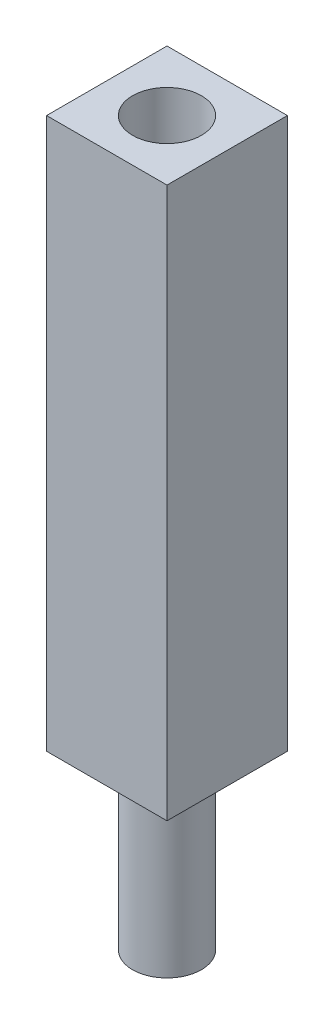
ISO-10303-21;
HEADER;
FILE_DESCRIPTION(('STEP AP214'),'2;1');
FILE_NAME('part.step','',(''),(''),'','','');
FILE_SCHEMA(('AUTOMOTIVE_DESIGN { 1 0 10303 214 1 1 1 1 }'));
ENDSEC;
DATA;
#1=APPLICATION_CONTEXT('core data for automotive mechanical design processes');
#2=APPLICATION_PROTOCOL_DEFINITION('international standard','automotive_design',2000,#1);
#3=PRODUCT_CONTEXT('',#1,'mechanical');
#4=PRODUCT('Part','Part','',(#3));
#5=PRODUCT_RELATED_PRODUCT_CATEGORY('part','',(#4));
#6=PRODUCT_DEFINITION_FORMATION('','',#4);
#7=PRODUCT_DEFINITION_CONTEXT('part definition',#1,'design');
#8=PRODUCT_DEFINITION('design','',#6,#7);
#9=PRODUCT_DEFINITION_SHAPE('','',#8);
#10=(LENGTH_UNIT() NAMED_UNIT(*) SI_UNIT(.MILLI.,.METRE.));
#11=(NAMED_UNIT(*) PLANE_ANGLE_UNIT() SI_UNIT($,.RADIAN.));
#12=(NAMED_UNIT(*) SI_UNIT($,.STERADIAN.) SOLID_ANGLE_UNIT());
#13=UNCERTAINTY_MEASURE_WITH_UNIT(LENGTH_MEASURE(1.E-05),#10,'distance_accuracy_value','');
#14=(GEOMETRIC_REPRESENTATION_CONTEXT(3) GLOBAL_UNCERTAINTY_ASSIGNED_CONTEXT((#13)) GLOBAL_UNIT_ASSIGNED_CONTEXT((#10,
#11,#12)) REPRESENTATION_CONTEXT('',''));
#15=CARTESIAN_POINT('',(0.,0.,0.));
#16=DIRECTION('',(0.,0.,1.));
#17=DIRECTION('',(1.,0.,0.));
#18=AXIS2_PLACEMENT_3D('',#15,#16,#17);
#19=CARTESIAN_POINT('',(0.,10.,0.));
#20=DIRECTION('',(0.,-1.,0.));
#21=DIRECTION('',(0.,0.,-1.));
#22=AXIS2_PLACEMENT_3D('',#19,#20,#21);
#23=CYLINDRICAL_SURFACE('',#22,2.);
#24=CARTESIAN_POINT('',(0.,10.,0.));
#25=DIRECTION('',(0.,1.,0.));
#26=DIRECTION('',(0.,0.,1.));
#27=AXIS2_PLACEMENT_3D('',#24,#25,#26);
#28=CIRCLE('',#27,2.);
#29=CARTESIAN_POINT('',(0.,10.,2.));
#30=VERTEX_POINT('',#29);
#31=EDGE_CURVE('E59',#30,#30,#28,.T.);
#32=ORIENTED_EDGE('',*,*,#31,.F.);
#33=EDGE_LOOP('',(#32));
#34=FACE_BOUND('',#33,.T.);
#35=CARTESIAN_POINT('',(0.,0.,0.));
#36=DIRECTION('',(0.,1.,0.));
#37=DIRECTION('',(0.,0.,1.));
#38=AXIS2_PLACEMENT_3D('',#35,#36,#37);
#39=CIRCLE('',#38,2.);
#40=CARTESIAN_POINT('',(0.,0.,2.));
#41=VERTEX_POINT('',#40);
#42=EDGE_CURVE('E131',#41,#41,#39,.T.);
#43=ORIENTED_EDGE('',*,*,#42,.T.);
#44=EDGE_LOOP('',(#43));
#45=FACE_BOUND('',#44,.T.);
#46=ADVANCED_FACE('F52',(#34,#45),#23,.T.);
#47=CARTESIAN_POINT('',(0.,0.,0.));
#48=DIRECTION('',(0.,1.,0.));
#49=DIRECTION('',(0.,0.,1.));
#50=AXIS2_PLACEMENT_3D('',#47,#48,#49);
#51=PLANE('',#50);
#52=ORIENTED_EDGE('',*,*,#42,.F.);
#53=EDGE_LOOP('',(#52));
#54=FACE_BOUND('',#53,.T.);
#55=ADVANCED_FACE('F139',(#54),#51,.F.);
#56=CARTESIAN_POINT('',(0.,12.,3.5));
#57=DIRECTION('',(0.,0.,1.));
#58=DIRECTION('',(1.,0.,0.));
#59=AXIS2_PLACEMENT_3D('',#56,#57,#58);
#60=PLANE('',#59);
#61=DIRECTION('',(-1.,0.,0.));
#62=VECTOR('',#61,1.);
#63=CARTESIAN_POINT('',(0.,10.,3.5));
#64=LINE('',#63,#62);
#65=CARTESIAN_POINT('',(3.5,10.,3.5));
#66=VERTEX_POINT('',#65);
#67=CARTESIAN_POINT('',(-3.5,10.,3.5));
#68=VERTEX_POINT('',#67);
#69=EDGE_CURVE('E123',#66,#68,#64,.T.);
#70=ORIENTED_EDGE('',*,*,#69,.F.);
#71=DIRECTION('',(0.,-1.,0.));
#72=VECTOR('',#71,1.);
#73=CARTESIAN_POINT('',(3.5,12.,3.5));
#74=LINE('',#73,#72);
#75=CARTESIAN_POINT('',(3.5,42.,3.5));
#76=VERTEX_POINT('',#75);
#77=EDGE_CURVE('E66',#76,#66,#74,.T.);
#78=ORIENTED_EDGE('',*,*,#77,.F.);
#79=DIRECTION('',(-1.,0.,0.));
#80=VECTOR('',#79,1.);
#81=CARTESIAN_POINT('',(0.,42.,3.5));
#82=LINE('',#81,#80);
#83=CARTESIAN_POINT('',(-3.5,42.,3.5));
#84=VERTEX_POINT('',#83);
#85=EDGE_CURVE('E112',#76,#84,#82,.T.);
#86=ORIENTED_EDGE('',*,*,#85,.T.);
#87=DIRECTION('',(0.,-1.,0.));
#88=VECTOR('',#87,1.);
#89=CARTESIAN_POINT('',(-3.5,12.,3.5));
#90=LINE('',#89,#88);
#91=EDGE_CURVE('E93',#84,#68,#90,.T.);
#92=ORIENTED_EDGE('',*,*,#91,.T.);
#93=EDGE_LOOP('',(#70,#78,#86,#92));
#94=FACE_BOUND('',#93,.T.);
#95=ADVANCED_FACE('F116',(#94),#60,.T.);
#96=CARTESIAN_POINT('',(3.5,12.,0.));
#97=DIRECTION('',(1.,0.,0.));
#98=DIRECTION('',(0.,0.,-1.));
#99=AXIS2_PLACEMENT_3D('',#96,#97,#98);
#100=PLANE('',#99);
#101=DIRECTION('',(0.,0.,1.));
#102=VECTOR('',#101,1.);
#103=CARTESIAN_POINT('',(3.5,10.,0.));
#104=LINE('',#103,#102);
#105=CARTESIAN_POINT('',(3.5,10.,-3.5));
#106=VERTEX_POINT('',#105);
#107=EDGE_CURVE('E104',#106,#66,#104,.T.);
#108=ORIENTED_EDGE('',*,*,#107,.F.);
#109=DIRECTION('',(0.,-1.,0.));
#110=VECTOR('',#109,1.);
#111=CARTESIAN_POINT('',(3.5,12.,-3.5));
#112=LINE('',#111,#110);
#113=CARTESIAN_POINT('',(3.5,42.,-3.5));
#114=VERTEX_POINT('',#113);
#115=EDGE_CURVE('E74',#114,#106,#112,.T.);
#116=ORIENTED_EDGE('',*,*,#115,.F.);
#117=DIRECTION('',(0.,0.,1.));
#118=VECTOR('',#117,1.);
#119=CARTESIAN_POINT('',(3.5,42.,0.));
#120=LINE('',#119,#118);
#121=EDGE_CURVE('E117',#114,#76,#120,.T.);
#122=ORIENTED_EDGE('',*,*,#121,.T.);
#123=ORIENTED_EDGE('',*,*,#77,.T.);
#124=EDGE_LOOP('',(#108,#116,#122,#123));
#125=FACE_BOUND('',#124,.T.);
#126=ADVANCED_FACE('F145',(#125),#100,.T.);
#127=CARTESIAN_POINT('',(0.,12.,-3.5));
#128=DIRECTION('',(0.,0.,1.));
#129=DIRECTION('',(1.,0.,0.));
#130=AXIS2_PLACEMENT_3D('',#127,#128,#129);
#131=PLANE('',#130);
#132=DIRECTION('',(-1.,0.,0.));
#133=VECTOR('',#132,1.);
#134=CARTESIAN_POINT('',(0.,10.,-3.5));
#135=LINE('',#134,#133);
#136=CARTESIAN_POINT('',(-3.5,10.,-3.5));
#137=VERTEX_POINT('',#136);
#138=EDGE_CURVE('E126',#106,#137,#135,.T.);
#139=ORIENTED_EDGE('',*,*,#138,.T.);
#140=DIRECTION('',(0.,-1.,0.));
#141=VECTOR('',#140,1.);
#142=CARTESIAN_POINT('',(-3.5,12.,-3.5));
#143=LINE('',#142,#141);
#144=CARTESIAN_POINT('',(-3.5,42.,-3.5));
#145=VERTEX_POINT('',#144);
#146=EDGE_CURVE('E103',#145,#137,#143,.T.);
#147=ORIENTED_EDGE('',*,*,#146,.F.);
#148=DIRECTION('',(-1.,0.,0.));
#149=VECTOR('',#148,1.);
#150=CARTESIAN_POINT('',(0.,42.,-3.5));
#151=LINE('',#150,#149);
#152=EDGE_CURVE('E113',#114,#145,#151,.T.);
#153=ORIENTED_EDGE('',*,*,#152,.F.);
#154=ORIENTED_EDGE('',*,*,#115,.T.);
#155=EDGE_LOOP('',(#139,#147,#153,#154));
#156=FACE_BOUND('',#155,.T.);
#157=ADVANCED_FACE('F152',(#156),#131,.F.);
#158=CARTESIAN_POINT('',(-3.5,12.,0.));
#159=DIRECTION('',(1.,0.,0.));
#160=DIRECTION('',(0.,0.,-1.));
#161=AXIS2_PLACEMENT_3D('',#158,#159,#160);
#162=PLANE('',#161);
#163=DIRECTION('',(0.,0.,1.));
#164=VECTOR('',#163,1.);
#165=CARTESIAN_POINT('',(-3.5,10.,0.));
#166=LINE('',#165,#164);
#167=EDGE_CURVE('E99',#137,#68,#166,.T.);
#168=ORIENTED_EDGE('',*,*,#167,.T.);
#169=ORIENTED_EDGE('',*,*,#91,.F.);
#170=DIRECTION('',(0.,0.,1.));
#171=VECTOR('',#170,1.);
#172=CARTESIAN_POINT('',(-3.5,42.,0.));
#173=LINE('',#172,#171);
#174=EDGE_CURVE('E97',#145,#84,#173,.T.);
#175=ORIENTED_EDGE('',*,*,#174,.F.);
#176=ORIENTED_EDGE('',*,*,#146,.T.);
#177=EDGE_LOOP('',(#168,#169,#175,#176));
#178=FACE_BOUND('',#177,.T.);
#179=ADVANCED_FACE('F95',(#178),#162,.F.);
#180=CARTESIAN_POINT('',(0.,10.,0.));
#181=DIRECTION('',(0.,1.,0.));
#182=DIRECTION('',(0.,0.,1.));
#183=AXIS2_PLACEMENT_3D('',#180,#181,#182);
#184=PLANE('',#183);
#185=ORIENTED_EDGE('',*,*,#31,.T.);
#186=EDGE_LOOP('',(#185));
#187=FACE_BOUND('',#186,.T.);
#188=ORIENTED_EDGE('',*,*,#69,.T.);
#189=ORIENTED_EDGE('',*,*,#167,.F.);
#190=ORIENTED_EDGE('',*,*,#138,.F.);
#191=ORIENTED_EDGE('',*,*,#107,.T.);
#192=EDGE_LOOP('',(#188,#189,#190,#191));
#193=FACE_BOUND('',#192,.T.);
#194=ADVANCED_FACE('F151',(#187,#193),#184,.F.);
#195=CARTESIAN_POINT('',(0.,42.,0.));
#196=DIRECTION('',(0.,-1.,0.));
#197=DIRECTION('',(0.,0.,-1.));
#198=AXIS2_PLACEMENT_3D('',#195,#196,#197);
#199=PLANE('',#198);
#200=ORIENTED_EDGE('',*,*,#174,.T.);
#201=ORIENTED_EDGE('',*,*,#85,.F.);
#202=ORIENTED_EDGE('',*,*,#121,.F.);
#203=ORIENTED_EDGE('',*,*,#152,.T.);
#204=EDGE_LOOP('',(#200,#201,#202,#203));
#205=FACE_BOUND('',#204,.T.);
#206=CARTESIAN_POINT('',(0.,42.,0.));
#207=DIRECTION('',(0.,1.,0.));
#208=DIRECTION('',(0.,0.,1.));
#209=AXIS2_PLACEMENT_3D('',#206,#207,#208);
#210=CIRCLE('',#209,2.);
#211=CARTESIAN_POINT('',(0.,42.,2.));
#212=VERTEX_POINT('',#211);
#213=EDGE_CURVE('E114',#212,#212,#210,.T.);
#214=ORIENTED_EDGE('',*,*,#213,.F.);
#215=EDGE_LOOP('',(#214));
#216=FACE_BOUND('',#215,.T.);
#217=ADVANCED_FACE('F109',(#205,#216),#199,.F.);
#218=CARTESIAN_POINT('',(0.,42.,0.));
#219=DIRECTION('',(0.,-1.,0.));
#220=DIRECTION('',(0.,0.,-1.));
#221=AXIS2_PLACEMENT_3D('',#218,#219,#220);
#222=CYLINDRICAL_SURFACE('',#221,2.);
#223=ORIENTED_EDGE('',*,*,#213,.T.);
#224=EDGE_LOOP('',(#223));
#225=FACE_BOUND('',#224,.T.);
#226=CARTESIAN_POINT('',(0.,12.,0.));
#227=DIRECTION('',(0.,1.,0.));
#228=DIRECTION('',(0.,0.,1.));
#229=AXIS2_PLACEMENT_3D('',#226,#227,#228);
#230=CIRCLE('',#229,2.);
#231=CARTESIAN_POINT('',(0.,12.,2.));
#232=VERTEX_POINT('',#231);
#233=EDGE_CURVE('E12',#232,#232,#230,.F.);
#234=ORIENTED_EDGE('',*,*,#233,.T.);
#235=EDGE_LOOP('',(#234));
#236=FACE_BOUND('',#235,.T.);
#237=ADVANCED_FACE('F163',(#225,#236),#222,.F.);
#238=CARTESIAN_POINT('',(0.,12.,0.));
#239=DIRECTION('',(0.,1.,0.));
#240=DIRECTION('',(0.,0.,1.));
#241=AXIS2_PLACEMENT_3D('',#238,#239,#240);
#242=PLANE('',#241);
#243=ORIENTED_EDGE('',*,*,#233,.F.);
#244=EDGE_LOOP('',(#243));
#245=FACE_BOUND('',#244,.T.);
#246=ADVANCED_FACE('F160',(#245),#242,.T.);
#247=CLOSED_SHELL('',(#46,#55,#95,#126,#157,#179,#194,#217,#237,#246));
#248=MANIFOLD_SOLID_BREP('B2',#247);
#249=ADVANCED_BREP_SHAPE_REPRESENTATION('',(#18,#248),#14);
#250=SHAPE_DEFINITION_REPRESENTATION(#9,#249);
ENDSEC;
END-ISO-10303-21;
